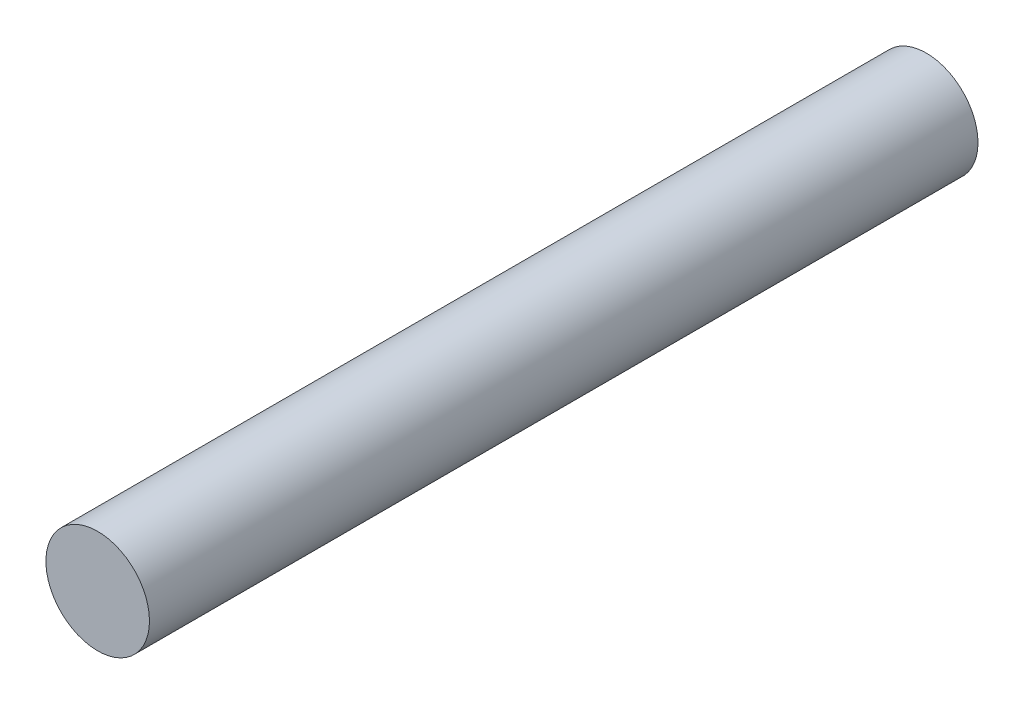
ISO-10303-21;
HEADER;
FILE_DESCRIPTION(('STEP AP214'),'2;1');
FILE_NAME('part.step','',(''),(''),'','','');
FILE_SCHEMA(('AUTOMOTIVE_DESIGN { 1 0 10303 214 1 1 1 1 }'));
ENDSEC;
DATA;
#1=APPLICATION_CONTEXT('core data for automotive mechanical design processes');
#2=APPLICATION_PROTOCOL_DEFINITION('international standard','automotive_design',2000,#1);
#3=PRODUCT_CONTEXT('',#1,'mechanical');
#4=PRODUCT('Part','Part','',(#3));
#5=PRODUCT_RELATED_PRODUCT_CATEGORY('part','',(#4));
#6=PRODUCT_DEFINITION_FORMATION('','',#4);
#7=PRODUCT_DEFINITION_CONTEXT('part definition',#1,'design');
#8=PRODUCT_DEFINITION('design','',#6,#7);
#9=PRODUCT_DEFINITION_SHAPE('','',#8);
#10=(LENGTH_UNIT() NAMED_UNIT(*) SI_UNIT(.MILLI.,.METRE.));
#11=(NAMED_UNIT(*) PLANE_ANGLE_UNIT() SI_UNIT($,.RADIAN.));
#12=(NAMED_UNIT(*) SI_UNIT($,.STERADIAN.) SOLID_ANGLE_UNIT());
#13=UNCERTAINTY_MEASURE_WITH_UNIT(LENGTH_MEASURE(1.E-05),#10,'distance_accuracy_value','');
#14=(GEOMETRIC_REPRESENTATION_CONTEXT(3) GLOBAL_UNCERTAINTY_ASSIGNED_CONTEXT((#13)) GLOBAL_UNIT_ASSIGNED_CONTEXT((#10,
#11,#12)) REPRESENTATION_CONTEXT('',''));
#15=CARTESIAN_POINT('',(0.,0.,0.));
#16=DIRECTION('',(0.,0.,1.));
#17=DIRECTION('',(1.,0.,0.));
#18=AXIS2_PLACEMENT_3D('',#15,#16,#17);
#19=CARTESIAN_POINT('',(0.,0.,76.2));
#20=DIRECTION('',(0.,0.,-1.));
#21=DIRECTION('',(-1.,0.,0.));
#22=AXIS2_PLACEMENT_3D('',#19,#20,#21);
#23=CYLINDRICAL_SURFACE('',#22,4.7625);
#24=CARTESIAN_POINT('',(0.,0.,76.2));
#25=DIRECTION('',(0.,0.,1.));
#26=DIRECTION('',(1.,0.,0.));
#27=AXIS2_PLACEMENT_3D('',#24,#25,#26);
#28=CIRCLE('',#27,4.7625);
#29=CARTESIAN_POINT('',(4.7625,0.,76.2));
#30=VERTEX_POINT('',#29);
#31=EDGE_CURVE('E10',#30,#30,#28,.T.);
#32=ORIENTED_EDGE('',*,*,#31,.F.);
#33=EDGE_LOOP('',(#32));
#34=FACE_BOUND('',#33,.T.);
#35=CARTESIAN_POINT('',(0.,0.,0.));
#36=DIRECTION('',(0.,0.,1.));
#37=DIRECTION('',(1.,0.,0.));
#38=AXIS2_PLACEMENT_3D('',#35,#36,#37);
#39=CIRCLE('',#38,4.7625);
#40=CARTESIAN_POINT('',(4.7625,0.,0.));
#41=VERTEX_POINT('',#40);
#42=EDGE_CURVE('E40',#41,#41,#39,.T.);
#43=ORIENTED_EDGE('',*,*,#42,.T.);
#44=EDGE_LOOP('',(#43));
#45=FACE_BOUND('',#44,.T.);
#46=ADVANCED_FACE('F37',(#34,#45),#23,.T.);
#47=CARTESIAN_POINT('',(0.,0.,76.2));
#48=DIRECTION('',(0.,0.,1.));
#49=DIRECTION('',(1.,0.,0.));
#50=AXIS2_PLACEMENT_3D('',#47,#48,#49);
#51=PLANE('',#50);
#52=ORIENTED_EDGE('',*,*,#31,.T.);
#53=EDGE_LOOP('',(#52));
#54=FACE_BOUND('',#53,.T.);
#55=ADVANCED_FACE('F54',(#54),#51,.T.);
#56=CARTESIAN_POINT('',(0.,0.,0.));
#57=DIRECTION('',(0.,0.,1.));
#58=DIRECTION('',(1.,0.,0.));
#59=AXIS2_PLACEMENT_3D('',#56,#57,#58);
#60=PLANE('',#59);
#61=ORIENTED_EDGE('',*,*,#42,.F.);
#62=EDGE_LOOP('',(#61));
#63=FACE_BOUND('',#62,.T.);
#64=ADVANCED_FACE('F52',(#63),#60,.F.);
#65=CLOSED_SHELL('',(#46,#55,#64));
#66=MANIFOLD_SOLID_BREP('B2',#65);
#67=ADVANCED_BREP_SHAPE_REPRESENTATION('',(#18,#66),#14);
#68=SHAPE_DEFINITION_REPRESENTATION(#9,#67);
ENDSEC;
END-ISO-10303-21;
